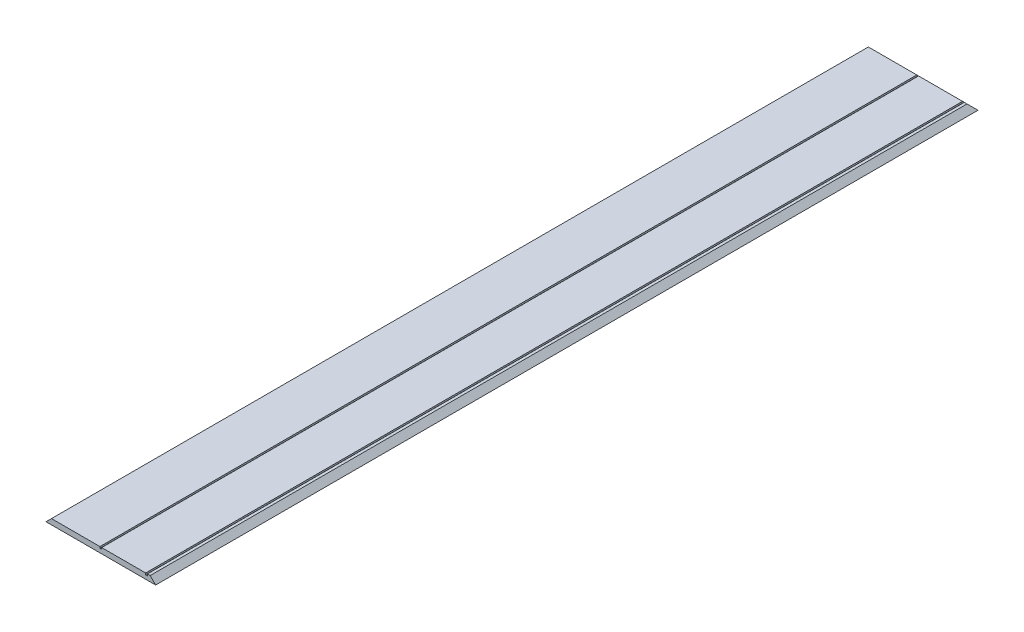
ISO-10303-21;
HEADER;
FILE_DESCRIPTION(('STEP AP214'),'2;1');
FILE_NAME('part.step','',(''),(''),'','','');
FILE_SCHEMA(('AUTOMOTIVE_DESIGN { 1 0 10303 214 1 1 1 1 }'));
ENDSEC;
DATA;
#1=APPLICATION_CONTEXT('core data for automotive mechanical design processes');
#2=APPLICATION_PROTOCOL_DEFINITION('international standard','automotive_design',2000,#1);
#3=PRODUCT_CONTEXT('',#1,'mechanical');
#4=PRODUCT('Part','Part','',(#3));
#5=PRODUCT_RELATED_PRODUCT_CATEGORY('part','',(#4));
#6=PRODUCT_DEFINITION_FORMATION('','',#4);
#7=PRODUCT_DEFINITION_CONTEXT('part definition',#1,'design');
#8=PRODUCT_DEFINITION('design','',#6,#7);
#9=PRODUCT_DEFINITION_SHAPE('','',#8);
#10=(LENGTH_UNIT() NAMED_UNIT(*) SI_UNIT(.MILLI.,.METRE.));
#11=(NAMED_UNIT(*) PLANE_ANGLE_UNIT() SI_UNIT($,.RADIAN.));
#12=(NAMED_UNIT(*) SI_UNIT($,.STERADIAN.) SOLID_ANGLE_UNIT());
#13=UNCERTAINTY_MEASURE_WITH_UNIT(LENGTH_MEASURE(1.E-05),#10,'distance_accuracy_value','');
#14=(GEOMETRIC_REPRESENTATION_CONTEXT(3) GLOBAL_UNCERTAINTY_ASSIGNED_CONTEXT((#13)) GLOBAL_UNIT_ASSIGNED_CONTEXT((#10,
#11,#12)) REPRESENTATION_CONTEXT('',''));
#15=CARTESIAN_POINT('',(0.,0.,0.));
#16=DIRECTION('',(0.,0.,1.));
#17=DIRECTION('',(1.,0.,0.));
#18=AXIS2_PLACEMENT_3D('',#15,#16,#17);
#19=CARTESIAN_POINT('',(10.0000000000001,9.99999999999997,1500.));
#20=DIRECTION('',(0.707106781186544,-0.707106781186551,0.));
#21=DIRECTION('',(0.707106781186551,0.707106781186544,0.));
#22=AXIS2_PLACEMENT_3D('',#19,#20,#21);
#23=PLANE('',#22);
#24=DIRECTION('',(0.,0.,-1.));
#25=VECTOR('',#24,1.);
#26=CARTESIAN_POINT('',(10.0000000000001,9.99999999999997,1500.));
#27=LINE('',#26,#25);
#28=CARTESIAN_POINT('',(10.0000000000001,9.99999999999997,1500.));
#29=VERTEX_POINT('',#28);
#30=CARTESIAN_POINT('',(10.0000000000001,9.99999999999997,10.));
#31=VERTEX_POINT('',#30);
#32=EDGE_CURVE('E220',#29,#31,#27,.T.);
#33=ORIENTED_EDGE('',*,*,#32,.T.);
#34=DIRECTION('',(-0.57735026918963,-0.577350269189624,-0.577350269189624));
#35=VECTOR('',#34,1.);
#36=CARTESIAN_POINT('',(39.4666666666672,39.4666666666667,39.4666666666668));
#37=LINE('',#36,#35);
#38=CARTESIAN_POINT('',(0.,0.,0.));
#39=VERTEX_POINT('',#38);
#40=EDGE_CURVE('E50',#31,#39,#37,.T.);
#41=ORIENTED_EDGE('',*,*,#40,.T.);
#42=DIRECTION('',(0.,0.,-1.));
#43=VECTOR('',#42,1.);
#44=CARTESIAN_POINT('',(0.,0.,1500.));
#45=LINE('',#44,#43);
#46=CARTESIAN_POINT('',(0.,0.,1500.));
#47=VERTEX_POINT('',#46);
#48=EDGE_CURVE('E137',#47,#39,#45,.T.);
#49=ORIENTED_EDGE('',*,*,#48,.F.);
#50=DIRECTION('',(-0.707106781186551,-0.707106781186544,0.));
#51=VECTOR('',#50,1.);
#52=CARTESIAN_POINT('',(10.0000000000001,9.99999999999997,1500.));
#53=LINE('',#52,#51);
#54=EDGE_CURVE('E144',#29,#47,#53,.T.);
#55=ORIENTED_EDGE('',*,*,#54,.F.);
#56=EDGE_LOOP('',(#33,#41,#49,#55));
#57=FACE_BOUND('',#56,.T.);
#58=ADVANCED_FACE('F40',(#57),#23,.F.);
#59=CARTESIAN_POINT('',(0.,0.,1500.));
#60=DIRECTION('',(0.,1.,0.));
#61=DIRECTION('',(0.,0.,1.));
#62=AXIS2_PLACEMENT_3D('',#59,#60,#61);
#63=PLANE('',#62);
#64=DIRECTION('',(1.,0.,0.));
#65=VECTOR('',#64,1.);
#66=CARTESIAN_POINT('',(0.,0.,0.));
#67=LINE('',#66,#65);
#68=CARTESIAN_POINT('',(200.,0.,0.));
#69=VERTEX_POINT('',#68);
#70=EDGE_CURVE('E44',#39,#69,#67,.T.);
#71=ORIENTED_EDGE('',*,*,#70,.T.);
#72=DIRECTION('',(0.,0.,-1.));
#73=VECTOR('',#72,1.);
#74=CARTESIAN_POINT('',(200.,0.,1500.));
#75=LINE('',#74,#73);
#76=CARTESIAN_POINT('',(200.,0.,1500.));
#77=VERTEX_POINT('',#76);
#78=EDGE_CURVE('E140',#77,#69,#75,.T.);
#79=ORIENTED_EDGE('',*,*,#78,.F.);
#80=DIRECTION('',(1.,0.,0.));
#81=VECTOR('',#80,1.);
#82=CARTESIAN_POINT('',(0.,0.,1500.));
#83=LINE('',#82,#81);
#84=EDGE_CURVE('E133',#47,#77,#83,.T.);
#85=ORIENTED_EDGE('',*,*,#84,.F.);
#86=ORIENTED_EDGE('',*,*,#48,.T.);
#87=EDGE_LOOP('',(#71,#79,#85,#86));
#88=FACE_BOUND('',#87,.T.);
#89=ADVANCED_FACE('F135',(#88),#63,.F.);
#90=CARTESIAN_POINT('',(200.,0.,1500.));
#91=DIRECTION('',(-0.707106781186541,-0.707106781186554,0.));
#92=DIRECTION('',(0.707106781186554,-0.707106781186541,0.));
#93=AXIS2_PLACEMENT_3D('',#90,#91,#92);
#94=PLANE('',#93);
#95=ORIENTED_EDGE('',*,*,#78,.T.);
#96=DIRECTION('',(-0.577350269189632,0.577350269189622,0.577350269189623));
#97=VECTOR('',#96,1.);
#98=CARTESIAN_POINT('',(190.,10.,10.));
#99=LINE('',#98,#97);
#100=CARTESIAN_POINT('',(190.,10.,10.));
#101=VERTEX_POINT('',#100);
#102=EDGE_CURVE('E165',#69,#101,#99,.T.);
#103=ORIENTED_EDGE('',*,*,#102,.T.);
#104=DIRECTION('',(0.,0.,-1.));
#105=VECTOR('',#104,1.);
#106=CARTESIAN_POINT('',(190.,10.,1500.));
#107=LINE('',#106,#105);
#108=CARTESIAN_POINT('',(190.,10.,1500.));
#109=VERTEX_POINT('',#108);
#110=EDGE_CURVE('E158',#109,#101,#107,.T.);
#111=ORIENTED_EDGE('',*,*,#110,.F.);
#112=DIRECTION('',(-0.707106781186554,0.707106781186541,0.));
#113=VECTOR('',#112,1.);
#114=CARTESIAN_POINT('',(200.,0.,1500.));
#115=LINE('',#114,#113);
#116=EDGE_CURVE('E143',#77,#109,#115,.T.);
#117=ORIENTED_EDGE('',*,*,#116,.F.);
#118=EDGE_LOOP('',(#95,#103,#111,#117));
#119=FACE_BOUND('',#118,.T.);
#120=ADVANCED_FACE('F199',(#119),#94,.F.);
#121=CARTESIAN_POINT('',(190.,10.,1500.));
#122=DIRECTION('',(0.,-1.,0.));
#123=DIRECTION('',(1.,0.,0.));
#124=AXIS2_PLACEMENT_3D('',#121,#122,#123);
#125=PLANE('',#124);
#126=ORIENTED_EDGE('',*,*,#110,.T.);
#127=DIRECTION('',(-1.,0.,0.));
#128=VECTOR('',#127,1.);
#129=CARTESIAN_POINT('',(185.,10.,10.));
#130=LINE('',#129,#128);
#131=CARTESIAN_POINT('',(185.,10.,10.));
#132=VERTEX_POINT('',#131);
#133=EDGE_CURVE('E153',#101,#132,#130,.T.);
#134=ORIENTED_EDGE('',*,*,#133,.T.);
#135=DIRECTION('',(0.,0.,-1.));
#136=VECTOR('',#135,1.);
#137=CARTESIAN_POINT('',(185.,10.,1500.));
#138=LINE('',#137,#136);
#139=CARTESIAN_POINT('',(185.,10.,1500.));
#140=VERTEX_POINT('',#139);
#141=EDGE_CURVE('E238',#140,#132,#138,.T.);
#142=ORIENTED_EDGE('',*,*,#141,.F.);
#143=DIRECTION('',(-1.,0.,0.));
#144=VECTOR('',#143,1.);
#145=CARTESIAN_POINT('',(190.,10.,1500.));
#146=LINE('',#145,#144);
#147=EDGE_CURVE('E203',#109,#140,#146,.T.);
#148=ORIENTED_EDGE('',*,*,#147,.F.);
#149=EDGE_LOOP('',(#126,#134,#142,#148));
#150=FACE_BOUND('',#149,.T.);
#151=ADVANCED_FACE('F241',(#150),#125,.F.);
#152=CARTESIAN_POINT('',(185.,10.,1500.));
#153=DIRECTION('',(1.,0.,0.));
#154=DIRECTION('',(0.,0.,-1.));
#155=AXIS2_PLACEMENT_3D('',#152,#153,#154);
#156=PLANE('',#155);
#157=ORIENTED_EDGE('',*,*,#141,.T.);
#158=DIRECTION('',(0.,-0.707106781186548,-0.707106781186548));
#159=VECTOR('',#158,1.);
#160=CARTESIAN_POINT('',(185.,10.,10.));
#161=LINE('',#160,#159);
#162=CARTESIAN_POINT('',(185.,7.,6.9999999999999));
#163=VERTEX_POINT('',#162);
#164=EDGE_CURVE('E156',#132,#163,#161,.T.);
#165=ORIENTED_EDGE('',*,*,#164,.T.);
#166=DIRECTION('',(0.,0.,-1.));
#167=VECTOR('',#166,1.);
#168=CARTESIAN_POINT('',(185.,7.,1500.));
#169=LINE('',#168,#167);
#170=CARTESIAN_POINT('',(185.,7.,1500.));
#171=VERTEX_POINT('',#170);
#172=EDGE_CURVE('E235',#171,#163,#169,.T.);
#173=ORIENTED_EDGE('',*,*,#172,.F.);
#174=DIRECTION('',(0.,-1.,0.));
#175=VECTOR('',#174,1.);
#176=CARTESIAN_POINT('',(185.,10.,1500.));
#177=LINE('',#176,#175);
#178=EDGE_CURVE('E205',#140,#171,#177,.T.);
#179=ORIENTED_EDGE('',*,*,#178,.F.);
#180=EDGE_LOOP('',(#157,#165,#173,#179));
#181=FACE_BOUND('',#180,.T.);
#182=ADVANCED_FACE('F246',(#181),#156,.F.);
#183=CARTESIAN_POINT('',(185.,7.,1500.));
#184=DIRECTION('',(0.,-1.,0.));
#185=DIRECTION('',(1.,0.,0.));
#186=AXIS2_PLACEMENT_3D('',#183,#184,#185);
#187=PLANE('',#186);
#188=ORIENTED_EDGE('',*,*,#172,.T.);
#189=DIRECTION('',(-1.,0.,0.));
#190=VECTOR('',#189,1.);
#191=CARTESIAN_POINT('',(181.8,7.,7.00000000000001));
#192=LINE('',#191,#190);
#193=CARTESIAN_POINT('',(181.8,7.,6.9999999999999));
#194=VERTEX_POINT('',#193);
#195=EDGE_CURVE('E164',#163,#194,#192,.T.);
#196=ORIENTED_EDGE('',*,*,#195,.T.);
#197=DIRECTION('',(0.,0.,-1.));
#198=VECTOR('',#197,1.);
#199=CARTESIAN_POINT('',(181.8,7.,1500.));
#200=LINE('',#199,#198);
#201=CARTESIAN_POINT('',(181.8,7.,1500.));
#202=VERTEX_POINT('',#201);
#203=EDGE_CURVE('E232',#202,#194,#200,.T.);
#204=ORIENTED_EDGE('',*,*,#203,.F.);
#205=DIRECTION('',(-1.,0.,0.));
#206=VECTOR('',#205,1.);
#207=CARTESIAN_POINT('',(185.,7.,1500.));
#208=LINE('',#207,#206);
#209=EDGE_CURVE('E209',#171,#202,#208,.T.);
#210=ORIENTED_EDGE('',*,*,#209,.F.);
#211=EDGE_LOOP('',(#188,#196,#204,#210));
#212=FACE_BOUND('',#211,.T.);
#213=ADVANCED_FACE('F250',(#212),#187,.F.);
#214=CARTESIAN_POINT('',(181.8,10.,1500.));
#215=DIRECTION('',(-1.,0.,0.));
#216=DIRECTION('',(0.,0.,1.));
#217=AXIS2_PLACEMENT_3D('',#214,#215,#216);
#218=PLANE('',#217);
#219=ORIENTED_EDGE('',*,*,#203,.T.);
#220=DIRECTION('',(0.,0.707106781186548,0.707106781186548));
#221=VECTOR('',#220,1.);
#222=CARTESIAN_POINT('',(181.8,10.,10.));
#223=LINE('',#222,#221);
#224=CARTESIAN_POINT('',(181.8,10.,10.));
#225=VERTEX_POINT('',#224);
#226=EDGE_CURVE('E173',#194,#225,#223,.T.);
#227=ORIENTED_EDGE('',*,*,#226,.T.);
#228=DIRECTION('',(0.,0.,-1.));
#229=VECTOR('',#228,1.);
#230=CARTESIAN_POINT('',(181.8,10.,1500.));
#231=LINE('',#230,#229);
#232=CARTESIAN_POINT('',(181.8,10.,1500.));
#233=VERTEX_POINT('',#232);
#234=EDGE_CURVE('E229',#233,#225,#231,.T.);
#235=ORIENTED_EDGE('',*,*,#234,.F.);
#236=DIRECTION('',(0.,1.,0.));
#237=VECTOR('',#236,1.);
#238=CARTESIAN_POINT('',(181.8,10.,1500.));
#239=LINE('',#238,#237);
#240=EDGE_CURVE('E211',#202,#233,#239,.T.);
#241=ORIENTED_EDGE('',*,*,#240,.F.);
#242=EDGE_LOOP('',(#219,#227,#235,#241));
#243=FACE_BOUND('',#242,.T.);
#244=ADVANCED_FACE('F257',(#243),#218,.F.);
#245=CARTESIAN_POINT('',(181.8,10.,1500.));
#246=DIRECTION('',(0.,-1.,0.));
#247=DIRECTION('',(1.,0.,0.));
#248=AXIS2_PLACEMENT_3D('',#245,#246,#247);
#249=PLANE('',#248);
#250=ORIENTED_EDGE('',*,*,#234,.T.);
#251=DIRECTION('',(-1.,0.,0.));
#252=VECTOR('',#251,1.);
#253=CARTESIAN_POINT('',(101.6,9.99999999999998,10.));
#254=LINE('',#253,#252);
#255=CARTESIAN_POINT('',(101.6,9.99999999999998,10.));
#256=VERTEX_POINT('',#255);
#257=EDGE_CURVE('E167',#225,#256,#254,.T.);
#258=ORIENTED_EDGE('',*,*,#257,.T.);
#259=DIRECTION('',(0.,0.,-1.));
#260=VECTOR('',#259,1.);
#261=CARTESIAN_POINT('',(101.6,9.99999999999998,1500.));
#262=LINE('',#261,#260);
#263=CARTESIAN_POINT('',(101.6,9.99999999999998,1500.));
#264=VERTEX_POINT('',#263);
#265=EDGE_CURVE('E226',#264,#256,#262,.T.);
#266=ORIENTED_EDGE('',*,*,#265,.F.);
#267=DIRECTION('',(-1.,0.,0.));
#268=VECTOR('',#267,1.);
#269=CARTESIAN_POINT('',(181.8,10.,1500.));
#270=LINE('',#269,#268);
#271=EDGE_CURVE('E213',#233,#264,#270,.T.);
#272=ORIENTED_EDGE('',*,*,#271,.F.);
#273=EDGE_LOOP('',(#250,#258,#266,#272));
#274=FACE_BOUND('',#273,.T.);
#275=ADVANCED_FACE('F260',(#274),#249,.F.);
#276=CARTESIAN_POINT('',(101.6,6.99999999999999,1500.));
#277=DIRECTION('',(1.,0.,0.));
#278=DIRECTION('',(0.,0.,-1.));
#279=AXIS2_PLACEMENT_3D('',#276,#277,#278);
#280=PLANE('',#279);
#281=ORIENTED_EDGE('',*,*,#265,.T.);
#282=DIRECTION('',(0.,-0.707106781186548,-0.707106781186548));
#283=VECTOR('',#282,1.);
#284=CARTESIAN_POINT('',(101.6,9.99999999999999,10.));
#285=LINE('',#284,#283);
#286=CARTESIAN_POINT('',(101.6,6.99999999999999,6.9999999999999));
#287=VERTEX_POINT('',#286);
#288=EDGE_CURVE('E169',#256,#287,#285,.T.);
#289=ORIENTED_EDGE('',*,*,#288,.T.);
#290=DIRECTION('',(0.,0.,-1.));
#291=VECTOR('',#290,1.);
#292=CARTESIAN_POINT('',(101.6,6.99999999999999,1500.));
#293=LINE('',#292,#291);
#294=CARTESIAN_POINT('',(101.6,6.99999999999999,1500.));
#295=VERTEX_POINT('',#294);
#296=EDGE_CURVE('E189',#295,#287,#293,.T.);
#297=ORIENTED_EDGE('',*,*,#296,.F.);
#298=DIRECTION('',(0.,-1.,0.));
#299=VECTOR('',#298,1.);
#300=CARTESIAN_POINT('',(101.6,6.99999999999999,1500.));
#301=LINE('',#300,#299);
#302=EDGE_CURVE('E215',#264,#295,#301,.T.);
#303=ORIENTED_EDGE('',*,*,#302,.F.);
#304=EDGE_LOOP('',(#281,#289,#297,#303));
#305=FACE_BOUND('',#304,.T.);
#306=ADVANCED_FACE('F263',(#305),#280,.F.);
#307=CARTESIAN_POINT('',(98.4,6.99999999999999,1500.));
#308=DIRECTION('',(0.,-1.,0.));
#309=DIRECTION('',(0.,0.,-1.));
#310=AXIS2_PLACEMENT_3D('',#307,#308,#309);
#311=PLANE('',#310);
#312=ORIENTED_EDGE('',*,*,#296,.T.);
#313=DIRECTION('',(-1.,0.,0.));
#314=VECTOR('',#313,1.);
#315=CARTESIAN_POINT('',(98.4,6.99999999999999,7.00000000000002));
#316=LINE('',#315,#314);
#317=CARTESIAN_POINT('',(98.4,6.99999999999999,6.9999999999999));
#318=VERTEX_POINT('',#317);
#319=EDGE_CURVE('E172',#287,#318,#316,.T.);
#320=ORIENTED_EDGE('',*,*,#319,.T.);
#321=DIRECTION('',(0.,0.,-1.));
#322=VECTOR('',#321,1.);
#323=CARTESIAN_POINT('',(98.4,6.99999999999999,1500.));
#324=LINE('',#323,#322);
#325=CARTESIAN_POINT('',(98.4,6.99999999999999,1500.));
#326=VERTEX_POINT('',#325);
#327=EDGE_CURVE('E186',#326,#318,#324,.T.);
#328=ORIENTED_EDGE('',*,*,#327,.F.);
#329=DIRECTION('',(-1.,0.,0.));
#330=VECTOR('',#329,1.);
#331=CARTESIAN_POINT('',(98.4,6.99999999999999,1500.));
#332=LINE('',#331,#330);
#333=EDGE_CURVE('E217',#295,#326,#332,.T.);
#334=ORIENTED_EDGE('',*,*,#333,.F.);
#335=EDGE_LOOP('',(#312,#320,#328,#334));
#336=FACE_BOUND('',#335,.T.);
#337=ADVANCED_FACE('F184',(#336),#311,.F.);
#338=CARTESIAN_POINT('',(98.4,6.99999999999999,1500.));
#339=DIRECTION('',(-1.,0.,0.));
#340=DIRECTION('',(0.,0.,1.));
#341=AXIS2_PLACEMENT_3D('',#338,#339,#340);
#342=PLANE('',#341);
#343=ORIENTED_EDGE('',*,*,#327,.T.);
#344=DIRECTION('',(0.,0.707106781186548,0.707106781186548));
#345=VECTOR('',#344,1.);
#346=CARTESIAN_POINT('',(98.4,9.99999999999998,10.));
#347=LINE('',#346,#345);
#348=CARTESIAN_POINT('',(98.4,9.99999999999998,10.));
#349=VERTEX_POINT('',#348);
#350=EDGE_CURVE('E11',#318,#349,#347,.T.);
#351=ORIENTED_EDGE('',*,*,#350,.T.);
#352=DIRECTION('',(0.,0.,-1.));
#353=VECTOR('',#352,1.);
#354=CARTESIAN_POINT('',(98.4,9.99999999999998,1500.));
#355=LINE('',#354,#353);
#356=CARTESIAN_POINT('',(98.4,9.99999999999998,1500.));
#357=VERTEX_POINT('',#356);
#358=EDGE_CURVE('E194',#357,#349,#355,.T.);
#359=ORIENTED_EDGE('',*,*,#358,.F.);
#360=DIRECTION('',(0.,1.,0.));
#361=VECTOR('',#360,1.);
#362=CARTESIAN_POINT('',(98.4,6.99999999999999,1500.));
#363=LINE('',#362,#361);
#364=EDGE_CURVE('E193',#326,#357,#363,.T.);
#365=ORIENTED_EDGE('',*,*,#364,.F.);
#366=EDGE_LOOP('',(#343,#351,#359,#365));
#367=FACE_BOUND('',#366,.T.);
#368=ADVANCED_FACE('F192',(#367),#342,.F.);
#369=CARTESIAN_POINT('',(98.4,9.99999999999998,1500.));
#370=DIRECTION('',(0.,-1.,0.));
#371=DIRECTION('',(1.,0.,0.));
#372=AXIS2_PLACEMENT_3D('',#369,#370,#371);
#373=PLANE('',#372);
#374=ORIENTED_EDGE('',*,*,#358,.T.);
#375=DIRECTION('',(-1.,0.,0.));
#376=VECTOR('',#375,1.);
#377=CARTESIAN_POINT('',(10.0000000000001,9.99999999999997,10.));
#378=LINE('',#377,#376);
#379=EDGE_CURVE('E63',#349,#31,#378,.T.);
#380=ORIENTED_EDGE('',*,*,#379,.T.);
#381=ORIENTED_EDGE('',*,*,#32,.F.);
#382=DIRECTION('',(-1.,0.,0.));
#383=VECTOR('',#382,1.);
#384=CARTESIAN_POINT('',(98.4,9.99999999999998,1500.));
#385=LINE('',#384,#383);
#386=EDGE_CURVE('E149',#357,#29,#385,.T.);
#387=ORIENTED_EDGE('',*,*,#386,.F.);
#388=EDGE_LOOP('',(#374,#380,#381,#387));
#389=FACE_BOUND('',#388,.T.);
#390=ADVANCED_FACE('F264',(#389),#373,.F.);
#391=CARTESIAN_POINT('',(0.,0.,1500.));
#392=DIRECTION('',(0.,0.,-1.));
#393=DIRECTION('',(-1.,0.,0.));
#394=AXIS2_PLACEMENT_3D('',#391,#392,#393);
#395=PLANE('',#394);
#396=ORIENTED_EDGE('',*,*,#54,.T.);
#397=ORIENTED_EDGE('',*,*,#84,.T.);
#398=ORIENTED_EDGE('',*,*,#116,.T.);
#399=ORIENTED_EDGE('',*,*,#147,.T.);
#400=ORIENTED_EDGE('',*,*,#178,.T.);
#401=ORIENTED_EDGE('',*,*,#209,.T.);
#402=ORIENTED_EDGE('',*,*,#240,.T.);
#403=ORIENTED_EDGE('',*,*,#271,.T.);
#404=ORIENTED_EDGE('',*,*,#302,.T.);
#405=ORIENTED_EDGE('',*,*,#333,.T.);
#406=ORIENTED_EDGE('',*,*,#364,.T.);
#407=ORIENTED_EDGE('',*,*,#386,.T.);
#408=EDGE_LOOP('',(#396,#397,#398,#399,#400,#401,#402,#403,#404,#405,#406,#407));
#409=FACE_BOUND('',#408,.T.);
#410=ADVANCED_FACE('F147',(#409),#395,.F.);
#411=CARTESIAN_POINT('',(98.4,9.99999999999998,10.));
#412=DIRECTION('',(0.,0.707106781186547,-0.707106781186547));
#413=DIRECTION('',(1.,0.,0.));
#414=AXIS2_PLACEMENT_3D('',#411,#412,#413);
#415=PLANE('',#414);
#416=ORIENTED_EDGE('',*,*,#350,.F.);
#417=ORIENTED_EDGE('',*,*,#319,.F.);
#418=ORIENTED_EDGE('',*,*,#288,.F.);
#419=ORIENTED_EDGE('',*,*,#257,.F.);
#420=ORIENTED_EDGE('',*,*,#226,.F.);
#421=ORIENTED_EDGE('',*,*,#195,.F.);
#422=ORIENTED_EDGE('',*,*,#164,.F.);
#423=ORIENTED_EDGE('',*,*,#133,.F.);
#424=ORIENTED_EDGE('',*,*,#102,.F.);
#425=ORIENTED_EDGE('',*,*,#70,.F.);
#426=ORIENTED_EDGE('',*,*,#40,.F.);
#427=ORIENTED_EDGE('',*,*,#379,.F.);
#428=EDGE_LOOP('',(#416,#417,#418,#419,#420,#421,#422,#423,#424,#425,#426,#427));
#429=FACE_BOUND('',#428,.T.);
#430=ADVANCED_FACE('F42',(#429),#415,.T.);
#431=CLOSED_SHELL('',(#58,#89,#120,#151,#182,#213,#244,#275,#306,#337,#368,#390,#410,#430));
#432=MANIFOLD_SOLID_BREP('B2',#431);
#433=ADVANCED_BREP_SHAPE_REPRESENTATION('',(#18,#432),#14);
#434=SHAPE_DEFINITION_REPRESENTATION(#9,#433);
ENDSEC;
END-ISO-10303-21;
